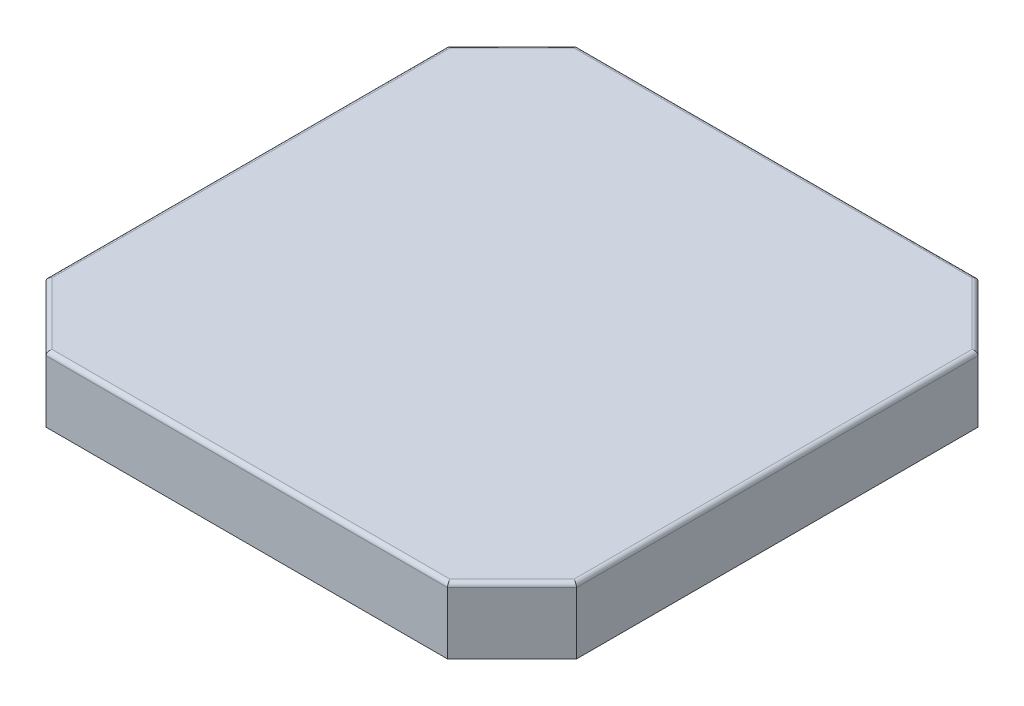
ISO-10303-21;
HEADER;
FILE_DESCRIPTION(('STEP AP214'),'2;1');
FILE_NAME('part.step','',(''),(''),'','','');
FILE_SCHEMA(('AUTOMOTIVE_DESIGN { 1 0 10303 214 1 1 1 1 }'));
ENDSEC;
DATA;
#1=APPLICATION_CONTEXT('core data for automotive mechanical design processes');
#2=APPLICATION_PROTOCOL_DEFINITION('international standard','automotive_design',2000,#1);
#3=PRODUCT_CONTEXT('',#1,'mechanical');
#4=PRODUCT('Part','Part','',(#3));
#5=PRODUCT_RELATED_PRODUCT_CATEGORY('part','',(#4));
#6=PRODUCT_DEFINITION_FORMATION('','',#4);
#7=PRODUCT_DEFINITION_CONTEXT('part definition',#1,'design');
#8=PRODUCT_DEFINITION('design','',#6,#7);
#9=PRODUCT_DEFINITION_SHAPE('','',#8);
#10=(LENGTH_UNIT() NAMED_UNIT(*) SI_UNIT(.MILLI.,.METRE.));
#11=(NAMED_UNIT(*) PLANE_ANGLE_UNIT() SI_UNIT($,.RADIAN.));
#12=(NAMED_UNIT(*) SI_UNIT($,.STERADIAN.) SOLID_ANGLE_UNIT());
#13=UNCERTAINTY_MEASURE_WITH_UNIT(LENGTH_MEASURE(1.E-05),#10,'distance_accuracy_value','');
#14=(GEOMETRIC_REPRESENTATION_CONTEXT(3) GLOBAL_UNCERTAINTY_ASSIGNED_CONTEXT((#13)) GLOBAL_UNIT_ASSIGNED_CONTEXT((#10,
#11,#12)) REPRESENTATION_CONTEXT('',''));
#15=CARTESIAN_POINT('',(0.,0.,0.));
#16=DIRECTION('',(0.,0.,1.));
#17=DIRECTION('',(1.,0.,0.));
#18=AXIS2_PLACEMENT_3D('',#15,#16,#17);
#19=CARTESIAN_POINT('',(11.4291229602581,1.47267857794964,-25.2));
#20=DIRECTION('',(0.,0.,1.));
#21=DIRECTION('',(1.,0.,0.));
#22=AXIS2_PLACEMENT_3D('',#19,#20,#21);
#23=CYLINDRICAL_SURFACE('',#22,0.500000000000001);
#24=CARTESIAN_POINT('',(11.4291229602581,1.47267857794964,-25.2));
#25=DIRECTION('',(0.,0.,-1.));
#26=DIRECTION('',(-1.,0.,0.));
#27=AXIS2_PLACEMENT_3D('',#24,#25,#26);
#28=CIRCLE('',#27,0.500000000000001);
#29=CARTESIAN_POINT('',(10.9291229602581,1.47267857794964,-25.2));
#30=VERTEX_POINT('',#29);
#31=EDGE_CURVE('E46',#30,#30,#28,.T.);
#32=ORIENTED_EDGE('',*,*,#31,.F.);
#33=EDGE_LOOP('',(#32));
#34=FACE_BOUND('',#33,.T.);
#35=CARTESIAN_POINT('',(11.4291229602581,1.47267857794964,-24.7));
#36=DIRECTION('',(0.,0.,-1.));
#37=DIRECTION('',(-1.,0.,0.));
#38=AXIS2_PLACEMENT_3D('',#35,#36,#37);
#39=CIRCLE('',#38,0.500000000000001);
#40=CARTESIAN_POINT('',(10.9291229602581,1.47267857794964,-24.7));
#41=VERTEX_POINT('',#40);
#42=EDGE_CURVE('E11',#41,#41,#39,.T.);
#43=ORIENTED_EDGE('',*,*,#42,.T.);
#44=EDGE_LOOP('',(#43));
#45=FACE_BOUND('',#44,.T.);
#46=ADVANCED_FACE('F42',(#34,#45),#23,.T.);
#47=CARTESIAN_POINT('',(11.4291229602581,1.47267857794964,-25.2));
#48=DIRECTION('',(0.,0.,-1.));
#49=DIRECTION('',(-1.,0.,0.));
#50=AXIS2_PLACEMENT_3D('',#47,#48,#49);
#51=PLANE('',#50);
#52=ORIENTED_EDGE('',*,*,#31,.T.);
#53=EDGE_LOOP('',(#52));
#54=FACE_BOUND('',#53,.T.);
#55=ADVANCED_FACE('F44',(#54),#51,.T.);
#56=CARTESIAN_POINT('',(11.4291229602581,1.47267857794964,-24.7));
#57=DIRECTION('',(0.,0.,-1.));
#58=DIRECTION('',(-1.,0.,0.));
#59=AXIS2_PLACEMENT_3D('',#56,#57,#58);
#60=PLANE('',#59);
#61=ORIENTED_EDGE('',*,*,#42,.F.);
#62=EDGE_LOOP('',(#61));
#63=FACE_BOUND('',#62,.T.);
#64=ADVANCED_FACE('F61',(#63),#60,.F.);
#65=CLOSED_SHELL('',(#46,#55,#64));
#66=MANIFOLD_SOLID_BREP('B2',#65);
#67=CARTESIAN_POINT('',(13.0302974561356,1.44275008269959,-25.2));
#68=DIRECTION('',(0.,0.,1.));
#69=DIRECTION('',(1.,0.,0.));
#70=AXIS2_PLACEMENT_3D('',#67,#68,#69);
#71=CYLINDRICAL_SURFACE('',#70,0.500000000000001);
#72=CARTESIAN_POINT('',(13.0302974561356,1.44275008269959,-25.2));
#73=DIRECTION('',(0.,0.,-1.));
#74=DIRECTION('',(-1.,0.,0.));
#75=AXIS2_PLACEMENT_3D('',#72,#73,#74);
#76=CIRCLE('',#75,0.500000000000001);
#77=CARTESIAN_POINT('',(12.5302974561356,1.44275008269959,-25.2));
#78=VERTEX_POINT('',#77);
#79=EDGE_CURVE('E41',#78,#78,#76,.T.);
#80=ORIENTED_EDGE('',*,*,#79,.F.);
#81=EDGE_LOOP('',(#80));
#82=FACE_BOUND('',#81,.T.);
#83=CARTESIAN_POINT('',(13.0302974561356,1.44275008269959,-24.7));
#84=DIRECTION('',(0.,0.,-1.));
#85=DIRECTION('',(-1.,0.,0.));
#86=AXIS2_PLACEMENT_3D('',#83,#84,#85);
#87=CIRCLE('',#86,0.500000000000001);
#88=CARTESIAN_POINT('',(12.5302974561356,1.44275008269959,-24.7));
#89=VERTEX_POINT('',#88);
#90=EDGE_CURVE('E95',#89,#89,#87,.T.);
#91=ORIENTED_EDGE('',*,*,#90,.T.);
#92=EDGE_LOOP('',(#91));
#93=FACE_BOUND('',#92,.T.);
#94=ADVANCED_FACE('F92',(#82,#93),#71,.T.);
#95=CARTESIAN_POINT('',(13.0302974561356,1.44275008269959,-25.2));
#96=DIRECTION('',(0.,0.,-1.));
#97=DIRECTION('',(-1.,0.,0.));
#98=AXIS2_PLACEMENT_3D('',#95,#96,#97);
#99=PLANE('',#98);
#100=ORIENTED_EDGE('',*,*,#79,.T.);
#101=EDGE_LOOP('',(#100));
#102=FACE_BOUND('',#101,.T.);
#103=ADVANCED_FACE('F107',(#102),#99,.T.);
#104=CARTESIAN_POINT('',(13.0302974561356,1.44275008269959,-24.7));
#105=DIRECTION('',(0.,0.,-1.));
#106=DIRECTION('',(-1.,0.,0.));
#107=AXIS2_PLACEMENT_3D('',#104,#105,#106);
#108=PLANE('',#107);
#109=ORIENTED_EDGE('',*,*,#90,.F.);
#110=EDGE_LOOP('',(#109));
#111=FACE_BOUND('',#110,.T.);
#112=ADVANCED_FACE('F105',(#111),#108,.F.);
#113=CLOSED_SHELL('',(#94,#103,#112));
#114=MANIFOLD_SOLID_BREP('B6',#113);
#115=CARTESIAN_POINT('',(0.,3.08,-24.7));
#116=DIRECTION('',(0.,0.,1.));
#117=DIRECTION('',(1.,0.,0.));
#118=AXIS2_PLACEMENT_3D('',#115,#116,#117);
#119=PLANE('',#118);
#120=DIRECTION('',(-1.,0.,0.));
#121=VECTOR('',#120,1.);
#122=CARTESIAN_POINT('',(0.,0.,-24.7));
#123=LINE('',#122,#121);
#124=CARTESIAN_POINT('',(21.7,0.,-24.7));
#125=VERTEX_POINT('',#124);
#126=CARTESIAN_POINT('',(15.35,0.,-24.7));
#127=VERTEX_POINT('',#126);
#128=EDGE_CURVE('E385',#125,#127,#123,.T.);
#129=ORIENTED_EDGE('',*,*,#128,.T.);
#130=DIRECTION('',(0.,-1.,0.));
#131=VECTOR('',#130,1.);
#132=CARTESIAN_POINT('',(15.35,0.,-24.7));
#133=LINE('',#132,#131);
#134=CARTESIAN_POINT('',(15.35,2.88,-24.7));
#135=VERTEX_POINT('',#134);
#136=EDGE_CURVE('E359',#135,#127,#133,.T.);
#137=ORIENTED_EDGE('',*,*,#136,.F.);
#138=DIRECTION('',(-1.,0.,0.));
#139=VECTOR('',#138,1.);
#140=CARTESIAN_POINT('',(0.,2.88,-24.7));
#141=LINE('',#140,#139);
#142=CARTESIAN_POINT('',(21.7,2.88,-24.7));
#143=VERTEX_POINT('',#142);
#144=EDGE_CURVE('E446',#135,#143,#141,.F.);
#145=ORIENTED_EDGE('',*,*,#144,.T.);
#146=DIRECTION('',(0.,-1.,0.));
#147=VECTOR('',#146,1.);
#148=CARTESIAN_POINT('',(21.7,3.08,-24.7));
#149=LINE('',#148,#147);
#150=EDGE_CURVE('E402',#143,#125,#149,.T.);
#151=ORIENTED_EDGE('',*,*,#150,.T.);
#152=EDGE_LOOP('',(#129,#137,#145,#151));
#153=FACE_BOUND('',#152,.T.);
#154=ADVANCED_FACE('F132',(#153),#119,.F.);
#155=CARTESIAN_POINT('',(0.,3.08,0.));
#156=DIRECTION('',(1.,0.,0.));
#157=DIRECTION('',(0.,0.,-1.));
#158=AXIS2_PLACEMENT_3D('',#155,#156,#157);
#159=PLANE('',#158);
#160=DIRECTION('',(0.,1.,0.));
#161=VECTOR('',#160,1.);
#162=CARTESIAN_POINT('',(0.,3.08,-3.00000000000001));
#163=LINE('',#162,#161);
#164=CARTESIAN_POINT('',(0.,0.,-3.00000000000001));
#165=VERTEX_POINT('',#164);
#166=CARTESIAN_POINT('',(0.,2.88,-3.00000000000001));
#167=VERTEX_POINT('',#166);
#168=EDGE_CURVE('E388',#165,#167,#163,.T.);
#169=ORIENTED_EDGE('',*,*,#168,.T.);
#170=DIRECTION('',(0.,0.,1.));
#171=VECTOR('',#170,1.);
#172=CARTESIAN_POINT('',(0.,2.88,0.));
#173=LINE('',#172,#171);
#174=CARTESIAN_POINT('',(0.,2.88,-21.7));
#175=VERTEX_POINT('',#174);
#176=EDGE_CURVE('E433',#167,#175,#173,.F.);
#177=ORIENTED_EDGE('',*,*,#176,.T.);
#178=DIRECTION('',(0.,-1.,0.));
#179=VECTOR('',#178,1.);
#180=CARTESIAN_POINT('',(0.,3.08,-21.7));
#181=LINE('',#180,#179);
#182=CARTESIAN_POINT('',(0.,0.,-21.7));
#183=VERTEX_POINT('',#182);
#184=EDGE_CURVE('E391',#175,#183,#181,.T.);
#185=ORIENTED_EDGE('',*,*,#184,.T.);
#186=DIRECTION('',(0.,0.,1.));
#187=VECTOR('',#186,1.);
#188=CARTESIAN_POINT('',(0.,0.,0.));
#189=LINE('',#188,#187);
#190=EDGE_CURVE('E374',#183,#165,#189,.T.);
#191=ORIENTED_EDGE('',*,*,#190,.T.);
#192=EDGE_LOOP('',(#169,#177,#185,#191));
#193=FACE_BOUND('',#192,.T.);
#194=ADVANCED_FACE('F530',(#193),#159,.F.);
#195=CARTESIAN_POINT('',(0.,3.08,0.));
#196=DIRECTION('',(0.,0.,-1.));
#197=DIRECTION('',(-1.,0.,0.));
#198=AXIS2_PLACEMENT_3D('',#195,#196,#197);
#199=PLANE('',#198);
#200=DIRECTION('',(0.,1.,0.));
#201=VECTOR('',#200,1.);
#202=CARTESIAN_POINT('',(21.7,3.08,0.));
#203=LINE('',#202,#201);
#204=CARTESIAN_POINT('',(21.7,0.,0.));
#205=VERTEX_POINT('',#204);
#206=CARTESIAN_POINT('',(21.7,2.88,0.));
#207=VERTEX_POINT('',#206);
#208=EDGE_CURVE('E413',#205,#207,#203,.T.);
#209=ORIENTED_EDGE('',*,*,#208,.T.);
#210=DIRECTION('',(1.,0.,0.));
#211=VECTOR('',#210,1.);
#212=CARTESIAN_POINT('',(0.,2.88,0.));
#213=LINE('',#212,#211);
#214=CARTESIAN_POINT('',(3.,2.88,0.));
#215=VERTEX_POINT('',#214);
#216=EDGE_CURVE('E438',#207,#215,#213,.F.);
#217=ORIENTED_EDGE('',*,*,#216,.T.);
#218=DIRECTION('',(0.,-1.,0.));
#219=VECTOR('',#218,1.);
#220=CARTESIAN_POINT('',(3.,3.08,0.));
#221=LINE('',#220,#219);
#222=CARTESIAN_POINT('',(3.,0.,0.));
#223=VERTEX_POINT('',#222);
#224=EDGE_CURVE('E411',#215,#223,#221,.T.);
#225=ORIENTED_EDGE('',*,*,#224,.T.);
#226=DIRECTION('',(1.,0.,0.));
#227=VECTOR('',#226,1.);
#228=CARTESIAN_POINT('',(0.,0.,0.));
#229=LINE('',#228,#227);
#230=EDGE_CURVE('E377',#223,#205,#229,.T.);
#231=ORIENTED_EDGE('',*,*,#230,.T.);
#232=EDGE_LOOP('',(#209,#217,#225,#231));
#233=FACE_BOUND('',#232,.T.);
#234=ADVANCED_FACE('F523',(#233),#199,.F.);
#235=CARTESIAN_POINT('',(24.7,3.08,0.));
#236=DIRECTION('',(-1.,0.,0.));
#237=DIRECTION('',(0.,0.,1.));
#238=AXIS2_PLACEMENT_3D('',#235,#236,#237);
#239=PLANE('',#238);
#240=DIRECTION('',(0.,1.,0.));
#241=VECTOR('',#240,1.);
#242=CARTESIAN_POINT('',(24.7,3.08,-21.7));
#243=LINE('',#242,#241);
#244=CARTESIAN_POINT('',(24.7,0.,-21.7));
#245=VERTEX_POINT('',#244);
#246=CARTESIAN_POINT('',(24.7,2.88,-21.7));
#247=VERTEX_POINT('',#246);
#248=EDGE_CURVE('E408',#245,#247,#243,.T.);
#249=ORIENTED_EDGE('',*,*,#248,.T.);
#250=DIRECTION('',(0.,0.,-1.));
#251=VECTOR('',#250,1.);
#252=CARTESIAN_POINT('',(24.7,2.88,0.));
#253=LINE('',#252,#251);
#254=CARTESIAN_POINT('',(24.7,2.88,-3.));
#255=VERTEX_POINT('',#254);
#256=EDGE_CURVE('E442',#247,#255,#253,.F.);
#257=ORIENTED_EDGE('',*,*,#256,.T.);
#258=DIRECTION('',(0.,-1.,0.));
#259=VECTOR('',#258,1.);
#260=CARTESIAN_POINT('',(24.7,3.08,-3.));
#261=LINE('',#260,#259);
#262=CARTESIAN_POINT('',(24.7,0.,-3.));
#263=VERTEX_POINT('',#262);
#264=EDGE_CURVE('E406',#255,#263,#261,.T.);
#265=ORIENTED_EDGE('',*,*,#264,.T.);
#266=DIRECTION('',(0.,0.,-1.));
#267=VECTOR('',#266,1.);
#268=CARTESIAN_POINT('',(24.7,0.,0.));
#269=LINE('',#268,#267);
#270=EDGE_CURVE('E381',#263,#245,#269,.T.);
#271=ORIENTED_EDGE('',*,*,#270,.T.);
#272=EDGE_LOOP('',(#249,#257,#265,#271));
#273=FACE_BOUND('',#272,.T.);
#274=ADVANCED_FACE('F482',(#273),#239,.F.);
#275=CARTESIAN_POINT('',(3.00000000000002,2.88,-24.7));
#276=VERTEX_POINT('',#275);
#277=CARTESIAN_POINT('',(9.35,2.88,-24.7));
#278=VERTEX_POINT('',#277);
#279=EDGE_CURVE('E447',#276,#278,#141,.F.);
#280=ORIENTED_EDGE('',*,*,#279,.T.);
#281=DIRECTION('',(0.,1.,0.));
#282=VECTOR('',#281,1.);
#283=CARTESIAN_POINT('',(9.35,0.,-24.7));
#284=LINE('',#283,#282);
#285=CARTESIAN_POINT('',(9.35,0.,-24.7));
#286=VERTEX_POINT('',#285);
#287=EDGE_CURVE('E362',#286,#278,#284,.T.);
#288=ORIENTED_EDGE('',*,*,#287,.F.);
#289=CARTESIAN_POINT('',(3.00000000000002,0.,-24.7));
#290=VERTEX_POINT('',#289);
#291=EDGE_CURVE('E384',#286,#290,#123,.T.);
#292=ORIENTED_EDGE('',*,*,#291,.T.);
#293=DIRECTION('',(0.,1.,0.));
#294=VECTOR('',#293,1.);
#295=CARTESIAN_POINT('',(3.00000000000002,3.08,-24.7));
#296=LINE('',#295,#294);
#297=EDGE_CURVE('E404',#290,#276,#296,.T.);
#298=ORIENTED_EDGE('',*,*,#297,.T.);
#299=EDGE_LOOP('',(#280,#288,#292,#298));
#300=FACE_BOUND('',#299,.T.);
#301=ADVANCED_FACE('F538',(#300),#119,.F.);
#302=CARTESIAN_POINT('',(0.,3.08,0.));
#303=DIRECTION('',(0.,-1.,0.));
#304=DIRECTION('',(0.,0.,-1.));
#305=AXIS2_PLACEMENT_3D('',#302,#303,#304);
#306=PLANE('',#305);
#307=DIRECTION('',(0.707106781186549,0.,-0.707106781186546));
#308=VECTOR('',#307,1.);
#309=CARTESIAN_POINT('',(0.141421356237311,3.08,-21.5585786437627));
#310=LINE('',#309,#308);
#311=CARTESIAN_POINT('',(3.08284271247464,3.08,-24.5));
#312=VERTEX_POINT('',#311);
#313=CARTESIAN_POINT('',(0.2,3.08,-21.6171572875254));
#314=VERTEX_POINT('',#313);
#315=EDGE_CURVE('E416',#312,#314,#310,.F.);
#316=ORIENTED_EDGE('',*,*,#315,.T.);
#317=DIRECTION('',(0.,0.,1.));
#318=VECTOR('',#317,1.);
#319=CARTESIAN_POINT('',(0.2,3.08,0.));
#320=LINE('',#319,#318);
#321=CARTESIAN_POINT('',(0.2,3.08,-3.08284271247463));
#322=VERTEX_POINT('',#321);
#323=EDGE_CURVE('E430',#314,#322,#320,.T.);
#324=ORIENTED_EDGE('',*,*,#323,.T.);
#325=DIRECTION('',(-0.707106781186546,0.,-0.707106781186549));
#326=VECTOR('',#325,1.);
#327=CARTESIAN_POINT('',(3.14142135623731,3.08,-0.14142135623731));
#328=LINE('',#327,#326);
#329=CARTESIAN_POINT('',(3.08284271247462,3.08,-0.2));
#330=VERTEX_POINT('',#329);
#331=EDGE_CURVE('E428',#322,#330,#328,.F.);
#332=ORIENTED_EDGE('',*,*,#331,.T.);
#333=DIRECTION('',(1.,0.,0.));
#334=VECTOR('',#333,1.);
#335=CARTESIAN_POINT('',(0.,3.08,-0.2));
#336=LINE('',#335,#334);
#337=CARTESIAN_POINT('',(21.6171572875254,3.08,-0.199999999999999));
#338=VERTEX_POINT('',#337);
#339=EDGE_CURVE('E426',#330,#338,#336,.T.);
#340=ORIENTED_EDGE('',*,*,#339,.T.);
#341=DIRECTION('',(-0.707106781186549,0.,0.707106781186546));
#342=VECTOR('',#341,1.);
#343=CARTESIAN_POINT('',(24.5585786437627,3.08,-3.14142135623731));
#344=LINE('',#343,#342);
#345=CARTESIAN_POINT('',(24.5,3.08,-3.08284271247462));
#346=VERTEX_POINT('',#345);
#347=EDGE_CURVE('E424',#338,#346,#344,.F.);
#348=ORIENTED_EDGE('',*,*,#347,.T.);
#349=DIRECTION('',(0.,0.,-1.));
#350=VECTOR('',#349,1.);
#351=CARTESIAN_POINT('',(24.5,3.08,0.));
#352=LINE('',#351,#350);
#353=CARTESIAN_POINT('',(24.5,3.08,-21.6171572875254));
#354=VERTEX_POINT('',#353);
#355=EDGE_CURVE('E422',#346,#354,#352,.T.);
#356=ORIENTED_EDGE('',*,*,#355,.T.);
#357=DIRECTION('',(0.707106781186546,0.,0.707106781186549));
#358=VECTOR('',#357,1.);
#359=CARTESIAN_POINT('',(21.5585786437627,3.08,-24.5585786437627));
#360=LINE('',#359,#358);
#361=CARTESIAN_POINT('',(21.6171572875254,3.08,-24.5));
#362=VERTEX_POINT('',#361);
#363=EDGE_CURVE('E420',#354,#362,#360,.F.);
#364=ORIENTED_EDGE('',*,*,#363,.T.);
#365=DIRECTION('',(-1.,0.,0.));
#366=VECTOR('',#365,1.);
#367=CARTESIAN_POINT('',(0.,3.08,-24.5));
#368=LINE('',#367,#366);
#369=EDGE_CURVE('E418',#362,#312,#368,.T.);
#370=ORIENTED_EDGE('',*,*,#369,.T.);
#371=EDGE_LOOP('',(#316,#324,#332,#340,#348,#356,#364,#370));
#372=FACE_BOUND('',#371,.T.);
#373=ADVANCED_FACE('F509',(#372),#306,.F.);
#374=CARTESIAN_POINT('',(0.,0.,0.));
#375=DIRECTION('',(0.,-1.,0.));
#376=DIRECTION('',(0.,0.,-1.));
#377=AXIS2_PLACEMENT_3D('',#374,#375,#376);
#378=PLANE('',#377);
#379=DIRECTION('',(1.,0.,0.));
#380=VECTOR('',#379,1.);
#381=CARTESIAN_POINT('',(3.12426406871193,0.,-24.4));
#382=LINE('',#381,#380);
#383=CARTESIAN_POINT('',(3.12426406871193,0.,-24.4));
#384=VERTEX_POINT('',#383);
#385=CARTESIAN_POINT('',(9.35,0.,-24.4));
#386=VERTEX_POINT('',#385);
#387=EDGE_CURVE('E319',#384,#386,#382,.T.);
#388=ORIENTED_EDGE('',*,*,#387,.F.);
#389=DIRECTION('',(0.707106781186548,0.,-0.707106781186548));
#390=VECTOR('',#389,1.);
#391=CARTESIAN_POINT('',(3.12426406871193,0.,-24.4));
#392=LINE('',#391,#390);
#393=CARTESIAN_POINT('',(0.300000000000001,0.,-21.5757359312881));
#394=VERTEX_POINT('',#393);
#395=EDGE_CURVE('E557',#394,#384,#392,.T.);
#396=ORIENTED_EDGE('',*,*,#395,.F.);
#397=DIRECTION('',(0.,0.,-1.));
#398=VECTOR('',#397,1.);
#399=CARTESIAN_POINT('',(0.299999999999999,0.,-3.12426406871193));
#400=LINE('',#399,#398);
#401=CARTESIAN_POINT('',(0.299999999999999,0.,-3.12426406871193));
#402=VERTEX_POINT('',#401);
#403=EDGE_CURVE('E553',#402,#394,#400,.T.);
#404=ORIENTED_EDGE('',*,*,#403,.F.);
#405=DIRECTION('',(-0.707106781186548,0.,-0.707106781186548));
#406=VECTOR('',#405,1.);
#407=CARTESIAN_POINT('',(3.12426406871193,0.,-0.3));
#408=LINE('',#407,#406);
#409=CARTESIAN_POINT('',(3.12426406871193,0.,-0.3));
#410=VERTEX_POINT('',#409);
#411=EDGE_CURVE('E558',#410,#402,#408,.T.);
#412=ORIENTED_EDGE('',*,*,#411,.F.);
#413=DIRECTION('',(-1.,0.,0.));
#414=VECTOR('',#413,1.);
#415=CARTESIAN_POINT('',(3.12426406871193,0.,-0.3));
#416=LINE('',#415,#414);
#417=CARTESIAN_POINT('',(21.5757359312881,0.,-0.299999999999997));
#418=VERTEX_POINT('',#417);
#419=EDGE_CURVE('E563',#418,#410,#416,.T.);
#420=ORIENTED_EDGE('',*,*,#419,.F.);
#421=DIRECTION('',(-0.707106781186548,0.,0.707106781186547));
#422=VECTOR('',#421,1.);
#423=CARTESIAN_POINT('',(21.5757359312881,0.,-0.299999999999997));
#424=LINE('',#423,#422);
#425=CARTESIAN_POINT('',(24.4,0.,-3.12426406871193));
#426=VERTEX_POINT('',#425);
#427=EDGE_CURVE('E566',#426,#418,#424,.T.);
#428=ORIENTED_EDGE('',*,*,#427,.F.);
#429=DIRECTION('',(0.,0.,1.));
#430=VECTOR('',#429,1.);
#431=CARTESIAN_POINT('',(24.4,0.,-3.12426406871193));
#432=LINE('',#431,#430);
#433=CARTESIAN_POINT('',(24.4,0.,-21.5757359312881));
#434=VERTEX_POINT('',#433);
#435=EDGE_CURVE('E311',#434,#426,#432,.T.);
#436=ORIENTED_EDGE('',*,*,#435,.F.);
#437=DIRECTION('',(0.707106781186547,0.,0.707106781186548));
#438=VECTOR('',#437,1.);
#439=CARTESIAN_POINT('',(24.4,0.,-21.5757359312881));
#440=LINE('',#439,#438);
#441=CARTESIAN_POINT('',(21.5757359312881,0.,-24.4));
#442=VERTEX_POINT('',#441);
#443=EDGE_CURVE('E325',#442,#434,#440,.T.);
#444=ORIENTED_EDGE('',*,*,#443,.F.);
#445=CARTESIAN_POINT('',(15.35,0.,-24.4));
#446=VERTEX_POINT('',#445);
#447=EDGE_CURVE('E321',#446,#442,#382,.T.);
#448=ORIENTED_EDGE('',*,*,#447,.F.);
#449=DIRECTION('',(0.,0.,-1.));
#450=VECTOR('',#449,1.);
#451=CARTESIAN_POINT('',(15.35,0.,-2.61999999999998));
#452=LINE('',#451,#450);
#453=EDGE_CURVE('E366',#446,#127,#452,.T.);
#454=ORIENTED_EDGE('',*,*,#453,.T.);
#455=ORIENTED_EDGE('',*,*,#128,.F.);
#456=DIRECTION('',(-0.707106781186546,0.,-0.707106781186549));
#457=VECTOR('',#456,1.);
#458=CARTESIAN_POINT('',(23.2,0.,-23.2));
#459=LINE('',#458,#457);
#460=EDGE_CURVE('E397',#125,#245,#459,.F.);
#461=ORIENTED_EDGE('',*,*,#460,.T.);
#462=ORIENTED_EDGE('',*,*,#270,.F.);
#463=DIRECTION('',(0.707106781186549,0.,-0.707106781186546));
#464=VECTOR('',#463,1.);
#465=CARTESIAN_POINT('',(10.85,0.,10.85));
#466=LINE('',#465,#464);
#467=EDGE_CURVE('E395',#263,#205,#466,.F.);
#468=ORIENTED_EDGE('',*,*,#467,.T.);
#469=ORIENTED_EDGE('',*,*,#230,.F.);
#470=DIRECTION('',(0.707106781186546,0.,0.707106781186549));
#471=VECTOR('',#470,1.);
#472=CARTESIAN_POINT('',(1.50000000000001,0.,-1.5));
#473=LINE('',#472,#471);
#474=EDGE_CURVE('E393',#223,#165,#473,.F.);
#475=ORIENTED_EDGE('',*,*,#474,.T.);
#476=ORIENTED_EDGE('',*,*,#190,.F.);
#477=DIRECTION('',(-0.707106781186549,0.,0.707106781186546));
#478=VECTOR('',#477,1.);
#479=CARTESIAN_POINT('',(-10.85,0.,-10.85));
#480=LINE('',#479,#478);
#481=EDGE_CURVE('E399',#183,#290,#480,.F.);
#482=ORIENTED_EDGE('',*,*,#481,.T.);
#483=ORIENTED_EDGE('',*,*,#291,.F.);
#484=DIRECTION('',(0.,0.,-1.));
#485=VECTOR('',#484,1.);
#486=CARTESIAN_POINT('',(9.35,0.,-2.61999999999998));
#487=LINE('',#486,#485);
#488=EDGE_CURVE('E371',#386,#286,#487,.T.);
#489=ORIENTED_EDGE('',*,*,#488,.F.);
#490=EDGE_LOOP('',(#388,#396,#404,#412,#420,#428,#436,#444,#448,#454,#455,#461,#462,#468,#469,
#475,#476,#482,#483,#489));
#491=FACE_BOUND('',#490,.T.);
#492=ADVANCED_FACE('F492',(#491),#378,.T.);
#493=CARTESIAN_POINT('',(0.,3.08,-21.7));
#494=DIRECTION('',(0.707106781186546,0.,0.707106781186549));
#495=DIRECTION('',(0.,-1.,0.));
#496=AXIS2_PLACEMENT_3D('',#493,#494,#495);
#497=PLANE('',#496);
#498=ORIENTED_EDGE('',*,*,#184,.F.);
#499=DIRECTION('',(-0.707106781186549,0.,0.707106781186546));
#500=VECTOR('',#499,1.);
#501=CARTESIAN_POINT('',(3.00000000000002,2.88,-24.7));
#502=LINE('',#501,#500);
#503=EDGE_CURVE('E140',#175,#276,#502,.F.);
#504=ORIENTED_EDGE('',*,*,#503,.T.);
#505=ORIENTED_EDGE('',*,*,#297,.F.);
#506=ORIENTED_EDGE('',*,*,#481,.F.);
#507=EDGE_LOOP('',(#498,#504,#505,#506));
#508=FACE_BOUND('',#507,.T.);
#509=ADVANCED_FACE('F533',(#508),#497,.F.);
#510=CARTESIAN_POINT('',(21.7,3.08,-24.7));
#511=DIRECTION('',(-0.707106781186549,0.,0.707106781186546));
#512=DIRECTION('',(0.,-1.,0.));
#513=AXIS2_PLACEMENT_3D('',#510,#511,#512);
#514=PLANE('',#513);
#515=ORIENTED_EDGE('',*,*,#150,.F.);
#516=DIRECTION('',(-0.707106781186546,0.,-0.707106781186549));
#517=VECTOR('',#516,1.);
#518=CARTESIAN_POINT('',(24.7,2.88,-21.7));
#519=LINE('',#518,#517);
#520=EDGE_CURVE('E444',#143,#247,#519,.F.);
#521=ORIENTED_EDGE('',*,*,#520,.T.);
#522=ORIENTED_EDGE('',*,*,#248,.F.);
#523=ORIENTED_EDGE('',*,*,#460,.F.);
#524=EDGE_LOOP('',(#515,#521,#522,#523));
#525=FACE_BOUND('',#524,.T.);
#526=ADVANCED_FACE('F497',(#525),#514,.F.);
#527=CARTESIAN_POINT('',(24.7,3.08,-3.));
#528=DIRECTION('',(-0.707106781186546,0.,-0.707106781186549));
#529=DIRECTION('',(0.,-1.,0.));
#530=AXIS2_PLACEMENT_3D('',#527,#528,#529);
#531=PLANE('',#530);
#532=ORIENTED_EDGE('',*,*,#264,.F.);
#533=DIRECTION('',(0.707106781186549,0.,-0.707106781186546));
#534=VECTOR('',#533,1.);
#535=CARTESIAN_POINT('',(21.7,2.88,0.));
#536=LINE('',#535,#534);
#537=EDGE_CURVE('E440',#255,#207,#536,.F.);
#538=ORIENTED_EDGE('',*,*,#537,.T.);
#539=ORIENTED_EDGE('',*,*,#208,.F.);
#540=ORIENTED_EDGE('',*,*,#467,.F.);
#541=EDGE_LOOP('',(#532,#538,#539,#540));
#542=FACE_BOUND('',#541,.T.);
#543=ADVANCED_FACE('F486',(#542),#531,.F.);
#544=CARTESIAN_POINT('',(3.,3.08,0.));
#545=DIRECTION('',(0.707106781186549,0.,-0.707106781186546));
#546=DIRECTION('',(0.,-1.,0.));
#547=AXIS2_PLACEMENT_3D('',#544,#545,#546);
#548=PLANE('',#547);
#549=ORIENTED_EDGE('',*,*,#224,.F.);
#550=DIRECTION('',(0.707106781186546,0.,0.707106781186549));
#551=VECTOR('',#550,1.);
#552=CARTESIAN_POINT('',(0.,2.88,-3.00000000000001));
#553=LINE('',#552,#551);
#554=EDGE_CURVE('E436',#215,#167,#553,.F.);
#555=ORIENTED_EDGE('',*,*,#554,.T.);
#556=ORIENTED_EDGE('',*,*,#168,.F.);
#557=ORIENTED_EDGE('',*,*,#474,.F.);
#558=EDGE_LOOP('',(#549,#555,#556,#557));
#559=FACE_BOUND('',#558,.T.);
#560=ADVANCED_FACE('F526',(#559),#548,.F.);
#561=CARTESIAN_POINT('',(24.5,2.88,0.));
#562=DIRECTION('',(0.,0.,-1.));
#563=DIRECTION('',(-1.,0.,0.));
#564=AXIS2_PLACEMENT_3D('',#561,#562,#563);
#565=CYLINDRICAL_SURFACE('',#564,0.2);
#566=CARTESIAN_POINT('',(24.5,2.88,-3.08284271247462));
#567=DIRECTION('',(0.382683432365091,0.,-0.923879532511287));
#568=DIRECTION('',(-0.923879532511287,0.,-0.382683432365091));
#569=AXIS2_PLACEMENT_3D('',#566,#567,#568);
#570=ELLIPSE('',#569,0.216478440058479,0.2);
#571=EDGE_CURVE('E466',#255,#346,#570,.F.);
#572=ORIENTED_EDGE('',*,*,#571,.F.);
#573=ORIENTED_EDGE('',*,*,#256,.F.);
#574=CARTESIAN_POINT('',(24.5,2.88,-21.6171572875254));
#575=DIRECTION('',(-0.382683432365089,0.,-0.923879532511287));
#576=DIRECTION('',(-0.923879532511287,0.,0.382683432365089));
#577=AXIS2_PLACEMENT_3D('',#574,#575,#576);
#578=ELLIPSE('',#577,0.216478440058479,0.2);
#579=EDGE_CURVE('E378',#354,#247,#578,.T.);
#580=ORIENTED_EDGE('',*,*,#579,.F.);
#581=ORIENTED_EDGE('',*,*,#355,.F.);
#582=EDGE_LOOP('',(#572,#573,#580,#581));
#583=FACE_BOUND('',#582,.T.);
#584=ADVANCED_FACE('F134',(#583),#565,.T.);
#585=CARTESIAN_POINT('',(23.0585786437627,2.88,-23.0585786437627));
#586=DIRECTION('',(-0.707106781186546,0.,-0.707106781186549));
#587=DIRECTION('',(-0.707106781186549,0.,0.707106781186546));
#588=AXIS2_PLACEMENT_3D('',#585,#586,#587);
#589=CYLINDRICAL_SURFACE('',#588,0.2);
#590=ORIENTED_EDGE('',*,*,#579,.T.);
#591=ORIENTED_EDGE('',*,*,#520,.F.);
#592=CARTESIAN_POINT('',(21.6171572875254,2.88,-24.5));
#593=DIRECTION('',(-0.923879532511287,0.,-0.382683432365091));
#594=DIRECTION('',(-0.382683432365091,0.,0.923879532511287));
#595=AXIS2_PLACEMENT_3D('',#592,#593,#594);
#596=ELLIPSE('',#595,0.216478440058479,0.2);
#597=EDGE_CURVE('E463',#362,#143,#596,.T.);
#598=ORIENTED_EDGE('',*,*,#597,.F.);
#599=ORIENTED_EDGE('',*,*,#363,.F.);
#600=EDGE_LOOP('',(#590,#591,#598,#599));
#601=FACE_BOUND('',#600,.T.);
#602=ADVANCED_FACE('F473',(#601),#589,.T.);
#603=CARTESIAN_POINT('',(10.7085786437626,2.88,10.7085786437627));
#604=DIRECTION('',(0.707106781186549,0.,-0.707106781186546));
#605=DIRECTION('',(-0.707106781186546,0.,-0.707106781186549));
#606=AXIS2_PLACEMENT_3D('',#603,#604,#605);
#607=CYLINDRICAL_SURFACE('',#606,0.2);
#608=ORIENTED_EDGE('',*,*,#571,.T.);
#609=ORIENTED_EDGE('',*,*,#347,.F.);
#610=CARTESIAN_POINT('',(21.6171572875254,2.88,-0.200000000000001));
#611=DIRECTION('',(0.923879532511287,0.,-0.382683432365089));
#612=DIRECTION('',(-0.382683432365089,0.,-0.923879532511287));
#613=AXIS2_PLACEMENT_3D('',#610,#611,#612);
#614=ELLIPSE('',#613,0.216478440058479,0.2);
#615=EDGE_CURVE('E460',#207,#338,#614,.F.);
#616=ORIENTED_EDGE('',*,*,#615,.F.);
#617=ORIENTED_EDGE('',*,*,#537,.F.);
#618=EDGE_LOOP('',(#608,#609,#616,#617));
#619=FACE_BOUND('',#618,.T.);
#620=ADVANCED_FACE('F515',(#619),#607,.T.);
#621=CARTESIAN_POINT('',(0.,2.88,-24.5));
#622=DIRECTION('',(-1.,0.,0.));
#623=DIRECTION('',(0.,0.,1.));
#624=AXIS2_PLACEMENT_3D('',#621,#622,#623);
#625=CYLINDRICAL_SURFACE('',#624,0.2);
#626=ORIENTED_EDGE('',*,*,#597,.T.);
#627=ORIENTED_EDGE('',*,*,#144,.F.);
#628=DIRECTION('',(1.,0.,0.));
#629=VECTOR('',#628,1.);
#630=CARTESIAN_POINT('',(15.35,2.88,-24.7));
#631=LINE('',#630,#629);
#632=EDGE_CURVE('E364',#278,#135,#631,.T.);
#633=ORIENTED_EDGE('',*,*,#632,.F.);
#634=ORIENTED_EDGE('',*,*,#279,.F.);
#635=CARTESIAN_POINT('',(3.08284271247464,2.88,-24.5));
#636=DIRECTION('',(-0.923879532511287,0.,0.382683432365089));
#637=DIRECTION('',(0.382683432365089,0.,0.923879532511287));
#638=AXIS2_PLACEMENT_3D('',#635,#636,#637);
#639=ELLIPSE('',#638,0.216478440058479,0.2);
#640=EDGE_CURVE('E457',#312,#276,#639,.T.);
#641=ORIENTED_EDGE('',*,*,#640,.F.);
#642=ORIENTED_EDGE('',*,*,#369,.F.);
#643=EDGE_LOOP('',(#626,#627,#633,#634,#641,#642));
#644=FACE_BOUND('',#643,.T.);
#645=ADVANCED_FACE('F503',(#644),#625,.T.);
#646=CARTESIAN_POINT('',(0.,2.88,-0.2));
#647=DIRECTION('',(1.,0.,0.));
#648=DIRECTION('',(0.,0.,-1.));
#649=AXIS2_PLACEMENT_3D('',#646,#647,#648);
#650=CYLINDRICAL_SURFACE('',#649,0.2);
#651=ORIENTED_EDGE('',*,*,#615,.T.);
#652=ORIENTED_EDGE('',*,*,#339,.F.);
#653=CARTESIAN_POINT('',(3.08284271247462,2.88,-0.2));
#654=DIRECTION('',(0.923879532511287,0.,0.382683432365091));
#655=DIRECTION('',(0.382683432365091,0.,-0.923879532511287));
#656=AXIS2_PLACEMENT_3D('',#653,#654,#655);
#657=ELLIPSE('',#656,0.216478440058479,0.2);
#658=EDGE_CURVE('E454',#215,#330,#657,.F.);
#659=ORIENTED_EDGE('',*,*,#658,.F.);
#660=ORIENTED_EDGE('',*,*,#216,.F.);
#661=EDGE_LOOP('',(#651,#652,#659,#660));
#662=FACE_BOUND('',#661,.T.);
#663=ADVANCED_FACE('F518',(#662),#650,.T.);
#664=CARTESIAN_POINT('',(-10.7085786437627,2.88,-10.7085786437627));
#665=DIRECTION('',(-0.707106781186549,0.,0.707106781186546));
#666=DIRECTION('',(0.707106781186546,0.,0.707106781186549));
#667=AXIS2_PLACEMENT_3D('',#664,#665,#666);
#668=CYLINDRICAL_SURFACE('',#667,0.2);
#669=ORIENTED_EDGE('',*,*,#640,.T.);
#670=ORIENTED_EDGE('',*,*,#503,.F.);
#671=CARTESIAN_POINT('',(0.200000000000001,2.88,-21.6171572875254));
#672=DIRECTION('',(-0.382683432365091,0.,0.923879532511286));
#673=DIRECTION('',(-0.923879532511286,0.,-0.382683432365091));
#674=AXIS2_PLACEMENT_3D('',#671,#672,#673);
#675=ELLIPSE('',#674,0.216478440058479,0.2);
#676=EDGE_CURVE('E452',#314,#175,#675,.T.);
#677=ORIENTED_EDGE('',*,*,#676,.F.);
#678=ORIENTED_EDGE('',*,*,#315,.F.);
#679=EDGE_LOOP('',(#669,#670,#677,#678));
#680=FACE_BOUND('',#679,.T.);
#681=ADVANCED_FACE('F622',(#680),#668,.T.);
#682=CARTESIAN_POINT('',(1.64142135623731,2.88,-1.64142135623731));
#683=DIRECTION('',(0.707106781186546,0.,0.707106781186549));
#684=DIRECTION('',(0.707106781186549,0.,-0.707106781186546));
#685=AXIS2_PLACEMENT_3D('',#682,#683,#684);
#686=CYLINDRICAL_SURFACE('',#685,0.2);
#687=ORIENTED_EDGE('',*,*,#658,.T.);
#688=ORIENTED_EDGE('',*,*,#331,.F.);
#689=CARTESIAN_POINT('',(0.2,2.88,-3.08284271247463));
#690=DIRECTION('',(0.382683432365089,0.,0.923879532511287));
#691=DIRECTION('',(0.923879532511287,0.,-0.382683432365089));
#692=AXIS2_PLACEMENT_3D('',#689,#690,#691);
#693=ELLIPSE('',#692,0.216478440058479,0.2);
#694=EDGE_CURVE('E369',#167,#322,#693,.F.);
#695=ORIENTED_EDGE('',*,*,#694,.F.);
#696=ORIENTED_EDGE('',*,*,#554,.F.);
#697=EDGE_LOOP('',(#687,#688,#695,#696));
#698=FACE_BOUND('',#697,.T.);
#699=ADVANCED_FACE('F618',(#698),#686,.T.);
#700=CARTESIAN_POINT('',(0.2,2.88,0.));
#701=DIRECTION('',(0.,0.,1.));
#702=DIRECTION('',(1.,0.,0.));
#703=AXIS2_PLACEMENT_3D('',#700,#701,#702);
#704=CYLINDRICAL_SURFACE('',#703,0.2);
#705=ORIENTED_EDGE('',*,*,#676,.T.);
#706=ORIENTED_EDGE('',*,*,#176,.F.);
#707=ORIENTED_EDGE('',*,*,#694,.T.);
#708=ORIENTED_EDGE('',*,*,#323,.F.);
#709=EDGE_LOOP('',(#705,#706,#707,#708));
#710=FACE_BOUND('',#709,.T.);
#711=ADVANCED_FACE('F614',(#710),#704,.T.);
#712=CARTESIAN_POINT('',(15.35,0.,-2.61999999999998));
#713=DIRECTION('',(1.,0.,0.));
#714=DIRECTION('',(0.,0.,-1.));
#715=AXIS2_PLACEMENT_3D('',#712,#713,#714);
#716=PLANE('',#715);
#717=ORIENTED_EDGE('',*,*,#453,.F.);
#718=DIRECTION('',(0.,1.,0.));
#719=VECTOR('',#718,1.);
#720=CARTESIAN_POINT('',(15.35,0.,-24.4));
#721=LINE('',#720,#719);
#722=CARTESIAN_POINT('',(15.35,2.88,-24.4));
#723=VERTEX_POINT('',#722);
#724=EDGE_CURVE('E356',#446,#723,#721,.T.);
#725=ORIENTED_EDGE('',*,*,#724,.T.);
#726=DIRECTION('',(0.,0.,-1.));
#727=VECTOR('',#726,1.);
#728=CARTESIAN_POINT('',(15.35,2.88,-2.61999999999998));
#729=LINE('',#728,#727);
#730=EDGE_CURVE('E367',#723,#135,#729,.T.);
#731=ORIENTED_EDGE('',*,*,#730,.T.);
#732=ORIENTED_EDGE('',*,*,#136,.T.);
#733=EDGE_LOOP('',(#717,#725,#731,#732));
#734=FACE_BOUND('',#733,.T.);
#735=ADVANCED_FACE('F617',(#734),#716,.F.);
#736=CARTESIAN_POINT('',(15.35,2.88,-2.61999999999998));
#737=DIRECTION('',(0.,1.,0.));
#738=DIRECTION('',(0.,0.,1.));
#739=AXIS2_PLACEMENT_3D('',#736,#737,#738);
#740=PLANE('',#739);
#741=ORIENTED_EDGE('',*,*,#730,.F.);
#742=DIRECTION('',(1.,0.,0.));
#743=VECTOR('',#742,1.);
#744=CARTESIAN_POINT('',(3.12426406871193,2.88,-24.4));
#745=LINE('',#744,#743);
#746=CARTESIAN_POINT('',(21.5757359312881,2.88,-24.4));
#747=VERTEX_POINT('',#746);
#748=EDGE_CURVE('E332',#723,#747,#745,.T.);
#749=ORIENTED_EDGE('',*,*,#748,.T.);
#750=DIRECTION('',(0.707106781186547,0.,0.707106781186548));
#751=VECTOR('',#750,1.);
#752=CARTESIAN_POINT('',(24.4,2.88,-21.5757359312881));
#753=LINE('',#752,#751);
#754=CARTESIAN_POINT('',(24.4,2.88,-21.5757359312881));
#755=VERTEX_POINT('',#754);
#756=EDGE_CURVE('E317',#747,#755,#753,.T.);
#757=ORIENTED_EDGE('',*,*,#756,.T.);
#758=DIRECTION('',(0.,0.,1.));
#759=VECTOR('',#758,1.);
#760=CARTESIAN_POINT('',(24.4,2.88,-3.12426406871193));
#761=LINE('',#760,#759);
#762=CARTESIAN_POINT('',(24.4,2.88,-3.12426406871193));
#763=VERTEX_POINT('',#762);
#764=EDGE_CURVE('E308',#755,#763,#761,.T.);
#765=ORIENTED_EDGE('',*,*,#764,.T.);
#766=DIRECTION('',(-0.707106781186548,0.,0.707106781186547));
#767=VECTOR('',#766,1.);
#768=CARTESIAN_POINT('',(21.5757359312881,2.88,-0.299999999999997));
#769=LINE('',#768,#767);
#770=CARTESIAN_POINT('',(21.5757359312881,2.88,-0.299999999999997));
#771=VERTEX_POINT('',#770);
#772=EDGE_CURVE('E296',#763,#771,#769,.T.);
#773=ORIENTED_EDGE('',*,*,#772,.T.);
#774=DIRECTION('',(-1.,0.,0.));
#775=VECTOR('',#774,1.);
#776=CARTESIAN_POINT('',(3.12426406871193,2.88,-0.3));
#777=LINE('',#776,#775);
#778=CARTESIAN_POINT('',(3.12426406871193,2.88,-0.3));
#779=VERTEX_POINT('',#778);
#780=EDGE_CURVE('E346',#771,#779,#777,.T.);
#781=ORIENTED_EDGE('',*,*,#780,.T.);
#782=DIRECTION('',(-0.707106781186547,0.,-0.707106781186548));
#783=VECTOR('',#782,1.);
#784=CARTESIAN_POINT('',(3.12426406871193,2.88,-0.3));
#785=LINE('',#784,#783);
#786=CARTESIAN_POINT('',(0.299999999999999,2.88,-3.12426406871193));
#787=VERTEX_POINT('',#786);
#788=EDGE_CURVE('E342',#779,#787,#785,.T.);
#789=ORIENTED_EDGE('',*,*,#788,.T.);
#790=DIRECTION('',(0.,0.,-1.));
#791=VECTOR('',#790,1.);
#792=CARTESIAN_POINT('',(0.299999999999999,2.88,-3.12426406871193));
#793=LINE('',#792,#791);
#794=CARTESIAN_POINT('',(0.300000000000001,2.88,-21.5757359312881));
#795=VERTEX_POINT('',#794);
#796=EDGE_CURVE('E338',#787,#795,#793,.T.);
#797=ORIENTED_EDGE('',*,*,#796,.T.);
#798=DIRECTION('',(0.707106781186548,0.,-0.707106781186548));
#799=VECTOR('',#798,1.);
#800=CARTESIAN_POINT('',(3.12426406871193,2.88,-24.4));
#801=LINE('',#800,#799);
#802=CARTESIAN_POINT('',(3.12426406871193,2.88,-24.4));
#803=VERTEX_POINT('',#802);
#804=EDGE_CURVE('E333',#795,#803,#801,.T.);
#805=ORIENTED_EDGE('',*,*,#804,.T.);
#806=CARTESIAN_POINT('',(9.35,2.88,-24.4));
#807=VERTEX_POINT('',#806);
#808=EDGE_CURVE('E330',#803,#807,#745,.T.);
#809=ORIENTED_EDGE('',*,*,#808,.T.);
#810=DIRECTION('',(0.,0.,-1.));
#811=VECTOR('',#810,1.);
#812=CARTESIAN_POINT('',(9.35,2.88,-2.61999999999998));
#813=LINE('',#812,#811);
#814=EDGE_CURVE('E147',#807,#278,#813,.T.);
#815=ORIENTED_EDGE('',*,*,#814,.T.);
#816=ORIENTED_EDGE('',*,*,#632,.T.);
#817=EDGE_LOOP('',(#741,#749,#757,#765,#773,#781,#789,#797,#805,#809,#815,#816));
#818=FACE_BOUND('',#817,.T.);
#819=ADVANCED_FACE('F315',(#818),#740,.F.);
#820=CARTESIAN_POINT('',(9.35,0.,-2.61999999999998));
#821=DIRECTION('',(-1.,0.,0.));
#822=DIRECTION('',(0.,0.,1.));
#823=AXIS2_PLACEMENT_3D('',#820,#821,#822);
#824=PLANE('',#823);
#825=ORIENTED_EDGE('',*,*,#814,.F.);
#826=DIRECTION('',(0.,-1.,0.));
#827=VECTOR('',#826,1.);
#828=CARTESIAN_POINT('',(9.35,0.,-24.4));
#829=LINE('',#828,#827);
#830=EDGE_CURVE('E90',#807,#386,#829,.T.);
#831=ORIENTED_EDGE('',*,*,#830,.T.);
#832=ORIENTED_EDGE('',*,*,#488,.T.);
#833=ORIENTED_EDGE('',*,*,#287,.T.);
#834=EDGE_LOOP('',(#825,#831,#832,#833));
#835=FACE_BOUND('',#834,.T.);
#836=ADVANCED_FACE('F540',(#835),#824,.F.);
#837=CARTESIAN_POINT('',(3.12426406871193,36.9625468531916,-24.4));
#838=DIRECTION('',(0.,0.,-1.));
#839=DIRECTION('',(-1.,0.,0.));
#840=AXIS2_PLACEMENT_3D('',#837,#838,#839);
#841=PLANE('',#840);
#842=ORIENTED_EDGE('',*,*,#447,.T.);
#843=DIRECTION('',(0.,-1.,0.));
#844=VECTOR('',#843,1.);
#845=CARTESIAN_POINT('',(21.5757359312881,36.9625468531916,-24.4));
#846=LINE('',#845,#844);
#847=EDGE_CURVE('E329',#747,#442,#846,.T.);
#848=ORIENTED_EDGE('',*,*,#847,.F.);
#849=ORIENTED_EDGE('',*,*,#748,.F.);
#850=ORIENTED_EDGE('',*,*,#724,.F.);
#851=EDGE_LOOP('',(#842,#848,#849,#850));
#852=FACE_BOUND('',#851,.T.);
#853=ADVANCED_FACE('F731',(#852),#841,.F.);
#854=ORIENTED_EDGE('',*,*,#808,.F.);
#855=DIRECTION('',(0.,-1.,0.));
#856=VECTOR('',#855,1.);
#857=CARTESIAN_POINT('',(3.12426406871193,36.9625468531916,-24.4));
#858=LINE('',#857,#856);
#859=EDGE_CURVE('E336',#803,#384,#858,.T.);
#860=ORIENTED_EDGE('',*,*,#859,.T.);
#861=ORIENTED_EDGE('',*,*,#387,.T.);
#862=ORIENTED_EDGE('',*,*,#830,.F.);
#863=EDGE_LOOP('',(#854,#860,#861,#862));
#864=FACE_BOUND('',#863,.T.);
#865=ADVANCED_FACE('F542',(#864),#841,.F.);
#866=CARTESIAN_POINT('',(24.4,36.9625468531916,-3.12426406871193));
#867=DIRECTION('',(1.,0.,0.));
#868=DIRECTION('',(0.,0.,-1.));
#869=AXIS2_PLACEMENT_3D('',#866,#867,#868);
#870=PLANE('',#869);
#871=DIRECTION('',(0.,-1.,0.));
#872=VECTOR('',#871,1.);
#873=CARTESIAN_POINT('',(24.4,36.9625468531916,-21.5757359312881));
#874=LINE('',#873,#872);
#875=EDGE_CURVE('E328',#755,#434,#874,.T.);
#876=ORIENTED_EDGE('',*,*,#875,.T.);
#877=ORIENTED_EDGE('',*,*,#435,.T.);
#878=DIRECTION('',(0.,-1.,0.));
#879=VECTOR('',#878,1.);
#880=CARTESIAN_POINT('',(24.4,36.9625468531916,-3.12426406871193));
#881=LINE('',#880,#879);
#882=EDGE_CURVE('E300',#763,#426,#881,.T.);
#883=ORIENTED_EDGE('',*,*,#882,.F.);
#884=ORIENTED_EDGE('',*,*,#764,.F.);
#885=EDGE_LOOP('',(#876,#877,#883,#884));
#886=FACE_BOUND('',#885,.T.);
#887=ADVANCED_FACE('F307',(#886),#870,.F.);
#888=CARTESIAN_POINT('',(21.5757359312881,36.9625468531916,-0.299999999999997));
#889=DIRECTION('',(0.707106781186547,0.,0.707106781186548));
#890=DIRECTION('',(0.707106781186548,0.,-0.707106781186547));
#891=AXIS2_PLACEMENT_3D('',#888,#889,#890);
#892=PLANE('',#891);
#893=ORIENTED_EDGE('',*,*,#882,.T.);
#894=ORIENTED_EDGE('',*,*,#427,.T.);
#895=DIRECTION('',(0.,-1.,0.));
#896=VECTOR('',#895,1.);
#897=CARTESIAN_POINT('',(21.5757359312881,36.9625468531916,-0.299999999999997));
#898=LINE('',#897,#896);
#899=EDGE_CURVE('E302',#771,#418,#898,.T.);
#900=ORIENTED_EDGE('',*,*,#899,.F.);
#901=ORIENTED_EDGE('',*,*,#772,.F.);
#902=EDGE_LOOP('',(#893,#894,#900,#901));
#903=FACE_BOUND('',#902,.T.);
#904=ADVANCED_FACE('F298',(#903),#892,.F.);
#905=CARTESIAN_POINT('',(3.12426406871193,36.9625468531916,-0.3));
#906=DIRECTION('',(0.,0.,1.));
#907=DIRECTION('',(1.,0.,0.));
#908=AXIS2_PLACEMENT_3D('',#905,#906,#907);
#909=PLANE('',#908);
#910=ORIENTED_EDGE('',*,*,#899,.T.);
#911=ORIENTED_EDGE('',*,*,#419,.T.);
#912=DIRECTION('',(0.,-1.,0.));
#913=VECTOR('',#912,1.);
#914=CARTESIAN_POINT('',(3.12426406871193,36.9625468531916,-0.3));
#915=LINE('',#914,#913);
#916=EDGE_CURVE('E345',#779,#410,#915,.T.);
#917=ORIENTED_EDGE('',*,*,#916,.F.);
#918=ORIENTED_EDGE('',*,*,#780,.F.);
#919=EDGE_LOOP('',(#910,#911,#917,#918));
#920=FACE_BOUND('',#919,.T.);
#921=ADVANCED_FACE('F576',(#920),#909,.F.);
#922=CARTESIAN_POINT('',(3.12426406871193,36.9625468531916,-0.3));
#923=DIRECTION('',(-0.707106781186548,0.,0.707106781186548));
#924=DIRECTION('',(0.707106781186547,0.,0.707106781186548));
#925=AXIS2_PLACEMENT_3D('',#922,#923,#924);
#926=PLANE('',#925);
#927=ORIENTED_EDGE('',*,*,#916,.T.);
#928=ORIENTED_EDGE('',*,*,#411,.T.);
#929=DIRECTION('',(0.,-1.,0.));
#930=VECTOR('',#929,1.);
#931=CARTESIAN_POINT('',(0.299999999999999,36.9625468531916,-3.12426406871193));
#932=LINE('',#931,#930);
#933=EDGE_CURVE('E341',#787,#402,#932,.T.);
#934=ORIENTED_EDGE('',*,*,#933,.F.);
#935=ORIENTED_EDGE('',*,*,#788,.F.);
#936=EDGE_LOOP('',(#927,#928,#934,#935));
#937=FACE_BOUND('',#936,.T.);
#938=ADVANCED_FACE('F578',(#937),#926,.F.);
#939=CARTESIAN_POINT('',(0.299999999999999,36.9625468531916,-3.12426406871193));
#940=DIRECTION('',(-1.,0.,0.));
#941=DIRECTION('',(0.,0.,1.));
#942=AXIS2_PLACEMENT_3D('',#939,#940,#941);
#943=PLANE('',#942);
#944=ORIENTED_EDGE('',*,*,#933,.T.);
#945=ORIENTED_EDGE('',*,*,#403,.T.);
#946=DIRECTION('',(0.,-1.,0.));
#947=VECTOR('',#946,1.);
#948=CARTESIAN_POINT('',(0.300000000000001,36.9625468531916,-21.5757359312881));
#949=LINE('',#948,#947);
#950=EDGE_CURVE('E337',#795,#394,#949,.T.);
#951=ORIENTED_EDGE('',*,*,#950,.F.);
#952=ORIENTED_EDGE('',*,*,#796,.F.);
#953=EDGE_LOOP('',(#944,#945,#951,#952));
#954=FACE_BOUND('',#953,.T.);
#955=ADVANCED_FACE('F550',(#954),#943,.F.);
#956=CARTESIAN_POINT('',(3.12426406871193,36.9625468531916,-24.4));
#957=DIRECTION('',(-0.707106781186548,0.,-0.707106781186548));
#958=DIRECTION('',(-0.707106781186548,0.,0.707106781186548));
#959=AXIS2_PLACEMENT_3D('',#956,#957,#958);
#960=PLANE('',#959);
#961=ORIENTED_EDGE('',*,*,#950,.T.);
#962=ORIENTED_EDGE('',*,*,#395,.T.);
#963=ORIENTED_EDGE('',*,*,#859,.F.);
#964=ORIENTED_EDGE('',*,*,#804,.F.);
#965=EDGE_LOOP('',(#961,#962,#963,#964));
#966=FACE_BOUND('',#965,.T.);
#967=ADVANCED_FACE('F546',(#966),#960,.F.);
#968=CARTESIAN_POINT('',(24.4,36.9625468531916,-21.5757359312881));
#969=DIRECTION('',(0.707106781186548,0.,-0.707106781186547));
#970=DIRECTION('',(-0.707106781186547,0.,-0.707106781186548));
#971=AXIS2_PLACEMENT_3D('',#968,#969,#970);
#972=PLANE('',#971);
#973=ORIENTED_EDGE('',*,*,#847,.T.);
#974=ORIENTED_EDGE('',*,*,#443,.T.);
#975=ORIENTED_EDGE('',*,*,#875,.F.);
#976=ORIENTED_EDGE('',*,*,#756,.F.);
#977=EDGE_LOOP('',(#973,#974,#975,#976));
#978=FACE_BOUND('',#977,.T.);
#979=ADVANCED_FACE('F570',(#978),#972,.F.);
#980=CLOSED_SHELL('',(#154,#194,#234,#274,#301,#373,#492,#509,#526,#543,#560,#584,#602,#620,
#645,#663,#681,#699,#711,#735,#819,#836,#853,#865,#887,#904,#921,#938,#955,#967,#979));
#981=MANIFOLD_SOLID_BREP('B36',#980);
#982=ADVANCED_BREP_SHAPE_REPRESENTATION('',(#18,#66,#114,#981),#14);
#983=SHAPE_DEFINITION_REPRESENTATION(#9,#982);
ENDSEC;
END-ISO-10303-21;
